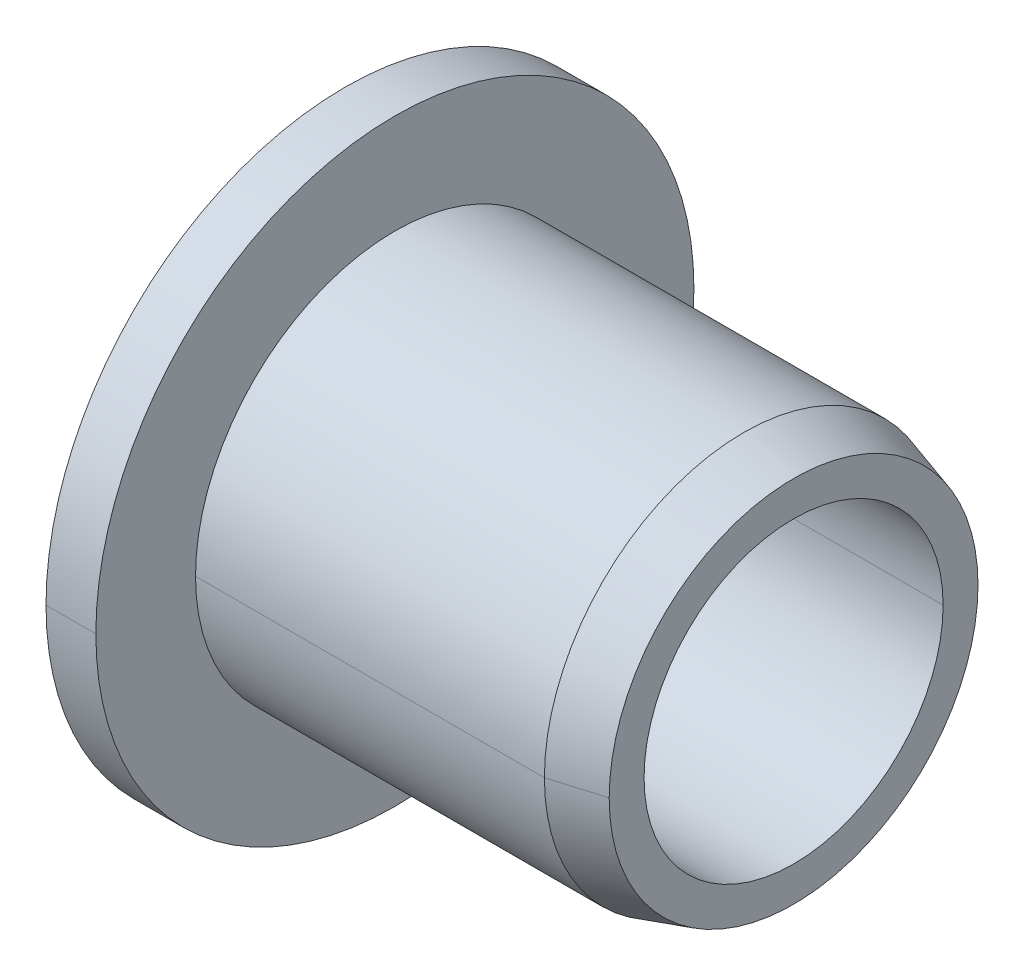
ISO-10303-21;
HEADER;
FILE_DESCRIPTION(('STEP AP214'),'2;1');
FILE_NAME('part.step','',(''),(''),'','','');
FILE_SCHEMA(('AUTOMOTIVE_DESIGN { 1 0 10303 214 1 1 1 1 }'));
ENDSEC;
DATA;
#1=APPLICATION_CONTEXT('core data for automotive mechanical design processes');
#2=APPLICATION_PROTOCOL_DEFINITION('international standard','automotive_design',2000,#1);
#3=PRODUCT_CONTEXT('',#1,'mechanical');
#4=PRODUCT('Part','Part','',(#3));
#5=PRODUCT_RELATED_PRODUCT_CATEGORY('part','',(#4));
#6=PRODUCT_DEFINITION_FORMATION('','',#4);
#7=PRODUCT_DEFINITION_CONTEXT('part definition',#1,'design');
#8=PRODUCT_DEFINITION('design','',#6,#7);
#9=PRODUCT_DEFINITION_SHAPE('','',#8);
#10=(LENGTH_UNIT() NAMED_UNIT(*) SI_UNIT(.MILLI.,.METRE.));
#11=(NAMED_UNIT(*) PLANE_ANGLE_UNIT() SI_UNIT($,.RADIAN.));
#12=(NAMED_UNIT(*) SI_UNIT($,.STERADIAN.) SOLID_ANGLE_UNIT());
#13=UNCERTAINTY_MEASURE_WITH_UNIT(LENGTH_MEASURE(1.E-05),#10,'distance_accuracy_value','');
#14=(GEOMETRIC_REPRESENTATION_CONTEXT(3) GLOBAL_UNCERTAINTY_ASSIGNED_CONTEXT((#13)) GLOBAL_UNIT_ASSIGNED_CONTEXT((#10,
#11,#12)) REPRESENTATION_CONTEXT('',''));
#15=CARTESIAN_POINT('',(0.,0.,0.));
#16=DIRECTION('',(0.,0.,1.));
#17=DIRECTION('',(1.,0.,0.));
#18=AXIS2_PLACEMENT_3D('',#15,#16,#17);
#19=CARTESIAN_POINT('',(0.,6.,0.));
#20=DIRECTION('',(-1.,0.,0.));
#21=DIRECTION('',(0.,0.,1.));
#22=AXIS2_PLACEMENT_3D('',#19,#20,#21);
#23=PLANE('',#22);
#24=CARTESIAN_POINT('',(0.,0.,0.));
#25=DIRECTION('',(1.,0.,0.));
#26=DIRECTION('',(0.,0.,-1.));
#27=AXIS2_PLACEMENT_3D('',#24,#25,#26);
#28=CIRCLE('',#27,3.3);
#29=CARTESIAN_POINT('',(0.,0.,-3.3));
#30=VERTEX_POINT('',#29);
#31=CARTESIAN_POINT('',(0.,0.,3.3));
#32=VERTEX_POINT('',#31);
#33=EDGE_CURVE('E11',#30,#32,#28,.T.);
#34=ORIENTED_EDGE('',*,*,#33,.T.);
#35=CARTESIAN_POINT('',(0.,0.,0.));
#36=DIRECTION('',(1.,0.,0.));
#37=DIRECTION('',(0.,0.,-1.));
#38=AXIS2_PLACEMENT_3D('',#35,#36,#37);
#39=CIRCLE('',#38,3.3);
#40=EDGE_CURVE('E25',#32,#30,#39,.T.);
#41=ORIENTED_EDGE('',*,*,#40,.T.);
#42=EDGE_LOOP('',(#34,#41));
#43=FACE_BOUND('',#42,.T.);
#44=CARTESIAN_POINT('',(0.,0.,0.));
#45=DIRECTION('',(1.,0.,0.));
#46=DIRECTION('',(0.,0.,-1.));
#47=AXIS2_PLACEMENT_3D('',#44,#45,#46);
#48=CIRCLE('',#47,6.);
#49=CARTESIAN_POINT('',(0.,0.,6.));
#50=VERTEX_POINT('',#49);
#51=CARTESIAN_POINT('',(0.,0.,-6.));
#52=VERTEX_POINT('',#51);
#53=EDGE_CURVE('E197',#50,#52,#48,.T.);
#54=ORIENTED_EDGE('',*,*,#53,.F.);
#55=CARTESIAN_POINT('',(0.,0.,0.));
#56=DIRECTION('',(1.,0.,0.));
#57=DIRECTION('',(0.,0.,-1.));
#58=AXIS2_PLACEMENT_3D('',#55,#56,#57);
#59=CIRCLE('',#58,6.);
#60=EDGE_CURVE('E192',#52,#50,#59,.T.);
#61=ORIENTED_EDGE('',*,*,#60,.F.);
#62=EDGE_LOOP('',(#54,#61));
#63=FACE_BOUND('',#62,.T.);
#64=ADVANCED_FACE('F17',(#43,#63),#23,.T.);
#65=CARTESIAN_POINT('',(9.,0.,0.));
#66=DIRECTION('',(1.,0.,0.));
#67=DIRECTION('',(0.,-1.,0.));
#68=AXIS2_PLACEMENT_3D('',#65,#66,#67);
#69=CYLINDRICAL_SURFACE('',#68,6.);
#70=DIRECTION('',(1.,0.,0.));
#71=VECTOR('',#70,1.);
#72=CARTESIAN_POINT('',(0.,0.,6.));
#73=LINE('',#72,#71);
#74=CARTESIAN_POINT('',(1.,0.,6.));
#75=VERTEX_POINT('',#74);
#76=EDGE_CURVE('E188',#50,#75,#73,.T.);
#77=ORIENTED_EDGE('',*,*,#76,.T.);
#78=CARTESIAN_POINT('',(1.,0.,0.));
#79=DIRECTION('',(1.,0.,0.));
#80=DIRECTION('',(0.,0.,-1.));
#81=AXIS2_PLACEMENT_3D('',#78,#79,#80);
#82=CIRCLE('',#81,6.);
#83=CARTESIAN_POINT('',(1.,0.,-6.));
#84=VERTEX_POINT('',#83);
#85=EDGE_CURVE('E183',#84,#75,#82,.T.);
#86=ORIENTED_EDGE('',*,*,#85,.F.);
#87=DIRECTION('',(1.,0.,0.));
#88=VECTOR('',#87,1.);
#89=CARTESIAN_POINT('',(0.,0.,-6.));
#90=LINE('',#89,#88);
#91=EDGE_CURVE('E178',#52,#84,#90,.T.);
#92=ORIENTED_EDGE('',*,*,#91,.F.);
#93=ORIENTED_EDGE('',*,*,#60,.T.);
#94=EDGE_LOOP('',(#77,#86,#92,#93));
#95=FACE_BOUND('',#94,.T.);
#96=ADVANCED_FACE('F213',(#95),#69,.T.);
#97=CARTESIAN_POINT('',(9.,0.,0.));
#98=DIRECTION('',(1.,0.,0.));
#99=DIRECTION('',(0.,1.,0.));
#100=AXIS2_PLACEMENT_3D('',#97,#98,#99);
#101=CYLINDRICAL_SURFACE('',#100,6.);
#102=ORIENTED_EDGE('',*,*,#76,.F.);
#103=ORIENTED_EDGE('',*,*,#53,.T.);
#104=ORIENTED_EDGE('',*,*,#91,.T.);
#105=CARTESIAN_POINT('',(1.,0.,0.));
#106=DIRECTION('',(1.,0.,0.));
#107=DIRECTION('',(0.,0.,-1.));
#108=AXIS2_PLACEMENT_3D('',#105,#106,#107);
#109=CIRCLE('',#108,6.);
#110=EDGE_CURVE('E173',#75,#84,#109,.T.);
#111=ORIENTED_EDGE('',*,*,#110,.F.);
#112=EDGE_LOOP('',(#102,#103,#104,#111));
#113=FACE_BOUND('',#112,.T.);
#114=ADVANCED_FACE('F208',(#113),#101,.T.);
#115=CARTESIAN_POINT('',(1.,4.,0.));
#116=DIRECTION('',(1.,0.,0.));
#117=DIRECTION('',(0.,0.,-1.));
#118=AXIS2_PLACEMENT_3D('',#115,#116,#117);
#119=PLANE('',#118);
#120=ORIENTED_EDGE('',*,*,#85,.T.);
#121=ORIENTED_EDGE('',*,*,#110,.T.);
#122=EDGE_LOOP('',(#120,#121));
#123=FACE_BOUND('',#122,.T.);
#124=CARTESIAN_POINT('',(1.,0.,0.));
#125=DIRECTION('',(1.,0.,0.));
#126=DIRECTION('',(0.,0.,-1.));
#127=AXIS2_PLACEMENT_3D('',#124,#125,#126);
#128=CIRCLE('',#127,4.);
#129=CARTESIAN_POINT('',(1.,0.,4.));
#130=VERTEX_POINT('',#129);
#131=CARTESIAN_POINT('',(1.,0.,-4.));
#132=VERTEX_POINT('',#131);
#133=EDGE_CURVE('E168',#130,#132,#128,.T.);
#134=ORIENTED_EDGE('',*,*,#133,.F.);
#135=CARTESIAN_POINT('',(1.,0.,0.));
#136=DIRECTION('',(1.,0.,0.));
#137=DIRECTION('',(0.,0.,-1.));
#138=AXIS2_PLACEMENT_3D('',#135,#136,#137);
#139=CIRCLE('',#138,4.);
#140=EDGE_CURVE('E163',#132,#130,#139,.T.);
#141=ORIENTED_EDGE('',*,*,#140,.F.);
#142=EDGE_LOOP('',(#134,#141));
#143=FACE_BOUND('',#142,.T.);
#144=ADVANCED_FACE('F215',(#123,#143),#119,.T.);
#145=CARTESIAN_POINT('',(9.,0.,0.));
#146=DIRECTION('',(1.,0.,0.));
#147=DIRECTION('',(0.,-1.,0.));
#148=AXIS2_PLACEMENT_3D('',#145,#146,#147);
#149=CYLINDRICAL_SURFACE('',#148,4.);
#150=DIRECTION('',(1.,0.,0.));
#151=VECTOR('',#150,1.);
#152=CARTESIAN_POINT('',(1.,0.,4.));
#153=LINE('',#152,#151);
#154=CARTESIAN_POINT('',(8.,0.,4.));
#155=VERTEX_POINT('',#154);
#156=EDGE_CURVE('E159',#130,#155,#153,.T.);
#157=ORIENTED_EDGE('',*,*,#156,.T.);
#158=CARTESIAN_POINT('',(8.,0.,0.));
#159=DIRECTION('',(1.,0.,0.));
#160=DIRECTION('',(0.,0.,-1.));
#161=AXIS2_PLACEMENT_3D('',#158,#159,#160);
#162=CIRCLE('',#161,4.);
#163=CARTESIAN_POINT('',(8.,0.,-4.));
#164=VERTEX_POINT('',#163);
#165=EDGE_CURVE('E154',#164,#155,#162,.T.);
#166=ORIENTED_EDGE('',*,*,#165,.F.);
#167=DIRECTION('',(1.,0.,0.));
#168=VECTOR('',#167,1.);
#169=CARTESIAN_POINT('',(1.,0.,-4.));
#170=LINE('',#169,#168);
#171=EDGE_CURVE('E149',#132,#164,#170,.T.);
#172=ORIENTED_EDGE('',*,*,#171,.F.);
#173=ORIENTED_EDGE('',*,*,#140,.T.);
#174=EDGE_LOOP('',(#157,#166,#172,#173));
#175=FACE_BOUND('',#174,.T.);
#176=ADVANCED_FACE('F218',(#175),#149,.T.);
#177=CARTESIAN_POINT('',(9.,0.,0.));
#178=DIRECTION('',(1.,0.,0.));
#179=DIRECTION('',(0.,1.,-5.8935951136395E-10));
#180=AXIS2_PLACEMENT_3D('',#177,#178,#179);
#181=CYLINDRICAL_SURFACE('',#180,4.);
#182=ORIENTED_EDGE('',*,*,#156,.F.);
#183=ORIENTED_EDGE('',*,*,#133,.T.);
#184=ORIENTED_EDGE('',*,*,#171,.T.);
#185=CARTESIAN_POINT('',(8.,0.,0.));
#186=DIRECTION('',(1.,0.,0.));
#187=DIRECTION('',(0.,0.,-1.));
#188=AXIS2_PLACEMENT_3D('',#185,#186,#187);
#189=CIRCLE('',#188,4.);
#190=EDGE_CURVE('E144',#155,#164,#189,.T.);
#191=ORIENTED_EDGE('',*,*,#190,.F.);
#192=EDGE_LOOP('',(#182,#183,#184,#191));
#193=FACE_BOUND('',#192,.T.);
#194=ADVANCED_FACE('F224',(#193),#181,.T.);
#195=CARTESIAN_POINT('',(9.,0.,0.));
#196=DIRECTION('',(-1.,0.,0.));
#197=DIRECTION('',(0.,1.,0.));
#198=AXIS2_PLACEMENT_3D('',#195,#196,#197);
#199=CONICAL_SURFACE('',#198,3.7,0.291456794477867);
#200=DIRECTION('',(-0.957826285221152,0.,-0.287347885566345));
#201=VECTOR('',#200,1.);
#202=CARTESIAN_POINT('',(9.,0.,-3.7));
#203=LINE('',#202,#201);
#204=CARTESIAN_POINT('',(9.,0.,-3.7));
#205=VERTEX_POINT('',#204);
#206=EDGE_CURVE('E139',#205,#164,#203,.T.);
#207=ORIENTED_EDGE('',*,*,#206,.F.);
#208=CARTESIAN_POINT('',(9.,0.,0.));
#209=DIRECTION('',(1.,0.,0.));
#210=DIRECTION('',(0.,0.,-1.));
#211=AXIS2_PLACEMENT_3D('',#208,#209,#210);
#212=CIRCLE('',#211,3.7);
#213=CARTESIAN_POINT('',(9.,0.,3.7));
#214=VERTEX_POINT('',#213);
#215=EDGE_CURVE('E134',#214,#205,#212,.T.);
#216=ORIENTED_EDGE('',*,*,#215,.F.);
#217=DIRECTION('',(-0.957826285221152,0.,0.287347885566345));
#218=VECTOR('',#217,1.);
#219=CARTESIAN_POINT('',(9.,0.,3.7));
#220=LINE('',#219,#218);
#221=EDGE_CURVE('E129',#214,#155,#220,.T.);
#222=ORIENTED_EDGE('',*,*,#221,.T.);
#223=ORIENTED_EDGE('',*,*,#190,.T.);
#224=EDGE_LOOP('',(#207,#216,#222,#223));
#225=FACE_BOUND('',#224,.T.);
#226=ADVANCED_FACE('F227',(#225),#199,.T.);
#227=CARTESIAN_POINT('',(9.,0.,0.));
#228=DIRECTION('',(-1.,0.,0.));
#229=DIRECTION('',(0.,-1.,0.));
#230=AXIS2_PLACEMENT_3D('',#227,#228,#229);
#231=CONICAL_SURFACE('',#230,3.7,0.291456794477867);
#232=ORIENTED_EDGE('',*,*,#206,.T.);
#233=ORIENTED_EDGE('',*,*,#165,.T.);
#234=ORIENTED_EDGE('',*,*,#221,.F.);
#235=CARTESIAN_POINT('',(9.,0.,0.));
#236=DIRECTION('',(1.,0.,0.));
#237=DIRECTION('',(0.,0.,-1.));
#238=AXIS2_PLACEMENT_3D('',#235,#236,#237);
#239=CIRCLE('',#238,3.7);
#240=EDGE_CURVE('E124',#205,#214,#239,.T.);
#241=ORIENTED_EDGE('',*,*,#240,.F.);
#242=EDGE_LOOP('',(#232,#233,#234,#241));
#243=FACE_BOUND('',#242,.T.);
#244=ADVANCED_FACE('F231',(#243),#231,.T.);
#245=CARTESIAN_POINT('',(9.,3.,0.));
#246=DIRECTION('',(1.,0.,0.));
#247=DIRECTION('',(0.,0.,-1.));
#248=AXIS2_PLACEMENT_3D('',#245,#246,#247);
#249=PLANE('',#248);
#250=ORIENTED_EDGE('',*,*,#240,.T.);
#251=ORIENTED_EDGE('',*,*,#215,.T.);
#252=EDGE_LOOP('',(#250,#251));
#253=FACE_BOUND('',#252,.T.);
#254=CARTESIAN_POINT('',(9.,0.,0.));
#255=DIRECTION('',(1.,0.,0.));
#256=DIRECTION('',(0.,0.,-1.));
#257=AXIS2_PLACEMENT_3D('',#254,#255,#256);
#258=CIRCLE('',#257,3.);
#259=CARTESIAN_POINT('',(9.,0.,3.));
#260=VERTEX_POINT('',#259);
#261=CARTESIAN_POINT('',(9.,0.,-3.));
#262=VERTEX_POINT('',#261);
#263=EDGE_CURVE('E95',#260,#262,#258,.T.);
#264=ORIENTED_EDGE('',*,*,#263,.F.);
#265=CARTESIAN_POINT('',(9.,0.,0.));
#266=DIRECTION('',(1.,0.,0.));
#267=DIRECTION('',(0.,0.,-1.));
#268=AXIS2_PLACEMENT_3D('',#265,#266,#267);
#269=CIRCLE('',#268,3.);
#270=EDGE_CURVE('E117',#262,#260,#269,.T.);
#271=ORIENTED_EDGE('',*,*,#270,.F.);
#272=EDGE_LOOP('',(#264,#271));
#273=FACE_BOUND('',#272,.T.);
#274=ADVANCED_FACE('F233',(#253,#273),#249,.T.);
#275=CARTESIAN_POINT('',(9.,0.,0.));
#276=DIRECTION('',(1.,0.,0.));
#277=DIRECTION('',(0.,-1.,0.));
#278=AXIS2_PLACEMENT_3D('',#275,#276,#277);
#279=CYLINDRICAL_SURFACE('',#278,3.);
#280=DIRECTION('',(1.,0.,0.));
#281=VECTOR('',#280,1.);
#282=CARTESIAN_POINT('',(0.300000000000001,0.,3.));
#283=LINE('',#282,#281);
#284=CARTESIAN_POINT('',(0.3,0.,3.));
#285=VERTEX_POINT('',#284);
#286=EDGE_CURVE('E85',#285,#260,#283,.T.);
#287=ORIENTED_EDGE('',*,*,#286,.F.);
#288=CARTESIAN_POINT('',(0.3,0.,0.));
#289=DIRECTION('',(1.,0.,0.));
#290=DIRECTION('',(0.,0.,-1.));
#291=AXIS2_PLACEMENT_3D('',#288,#289,#290);
#292=CIRCLE('',#291,3.);
#293=CARTESIAN_POINT('',(0.3,0.,-3.));
#294=VERTEX_POINT('',#293);
#295=EDGE_CURVE('E78',#294,#285,#292,.T.);
#296=ORIENTED_EDGE('',*,*,#295,.F.);
#297=DIRECTION('',(1.,0.,0.));
#298=VECTOR('',#297,1.);
#299=CARTESIAN_POINT('',(0.300000000000001,0.,-3.));
#300=LINE('',#299,#298);
#301=EDGE_CURVE('E82',#294,#262,#300,.T.);
#302=ORIENTED_EDGE('',*,*,#301,.T.);
#303=ORIENTED_EDGE('',*,*,#270,.T.);
#304=EDGE_LOOP('',(#287,#296,#302,#303));
#305=FACE_BOUND('',#304,.T.);
#306=ADVANCED_FACE('F80',(#305),#279,.F.);
#307=CARTESIAN_POINT('',(9.,0.,0.));
#308=DIRECTION('',(1.,0.,0.));
#309=DIRECTION('',(0.,1.,-1.61702901641324E-09));
#310=AXIS2_PLACEMENT_3D('',#307,#308,#309);
#311=CYLINDRICAL_SURFACE('',#310,3.);
#312=ORIENTED_EDGE('',*,*,#286,.T.);
#313=ORIENTED_EDGE('',*,*,#263,.T.);
#314=ORIENTED_EDGE('',*,*,#301,.F.);
#315=CARTESIAN_POINT('',(0.3,0.,0.));
#316=DIRECTION('',(1.,0.,0.));
#317=DIRECTION('',(0.,0.,-1.));
#318=AXIS2_PLACEMENT_3D('',#315,#316,#317);
#319=CIRCLE('',#318,3.);
#320=EDGE_CURVE('E93',#285,#294,#319,.T.);
#321=ORIENTED_EDGE('',*,*,#320,.F.);
#322=EDGE_LOOP('',(#312,#313,#314,#321));
#323=FACE_BOUND('',#322,.T.);
#324=ADVANCED_FACE('F92',(#323),#311,.F.);
#325=CARTESIAN_POINT('',(0.,0.,0.));
#326=DIRECTION('',(-1.,0.,0.));
#327=DIRECTION('',(0.,1.,0.));
#328=AXIS2_PLACEMENT_3D('',#325,#326,#327);
#329=CONICAL_SURFACE('',#328,3.3,0.785398163397448);
#330=DIRECTION('',(-0.707106781186548,0.,-0.707106781186548));
#331=VECTOR('',#330,1.);
#332=CARTESIAN_POINT('',(0.3,0.,-3.));
#333=LINE('',#332,#331);
#334=EDGE_CURVE('E99',#294,#30,#333,.T.);
#335=ORIENTED_EDGE('',*,*,#334,.T.);
#336=ORIENTED_EDGE('',*,*,#40,.F.);
#337=DIRECTION('',(-0.707106781186548,0.,0.707106781186548));
#338=VECTOR('',#337,1.);
#339=CARTESIAN_POINT('',(0.3,0.,3.));
#340=LINE('',#339,#338);
#341=EDGE_CURVE('E100',#285,#32,#340,.T.);
#342=ORIENTED_EDGE('',*,*,#341,.F.);
#343=ORIENTED_EDGE('',*,*,#320,.T.);
#344=EDGE_LOOP('',(#335,#336,#342,#343));
#345=FACE_BOUND('',#344,.T.);
#346=ADVANCED_FACE('F98',(#345),#329,.F.);
#347=CARTESIAN_POINT('',(0.,0.,0.));
#348=DIRECTION('',(-1.,0.,0.));
#349=DIRECTION('',(0.,-1.,0.));
#350=AXIS2_PLACEMENT_3D('',#347,#348,#349);
#351=CONICAL_SURFACE('',#350,3.3,0.785398163397448);
#352=ORIENTED_EDGE('',*,*,#334,.F.);
#353=ORIENTED_EDGE('',*,*,#295,.T.);
#354=ORIENTED_EDGE('',*,*,#341,.T.);
#355=ORIENTED_EDGE('',*,*,#33,.F.);
#356=EDGE_LOOP('',(#352,#353,#354,#355));
#357=FACE_BOUND('',#356,.T.);
#358=ADVANCED_FACE('F102',(#357),#351,.F.);
#359=CLOSED_SHELL('',(#64,#96,#114,#144,#176,#194,#226,#244,#274,#306,#324,#346,#358));
#360=MANIFOLD_SOLID_BREP('B1',#359);
#361=ADVANCED_BREP_SHAPE_REPRESENTATION('',(#18,#360),#14);
#362=SHAPE_DEFINITION_REPRESENTATION(#9,#361);
ENDSEC;
END-ISO-10303-21;
